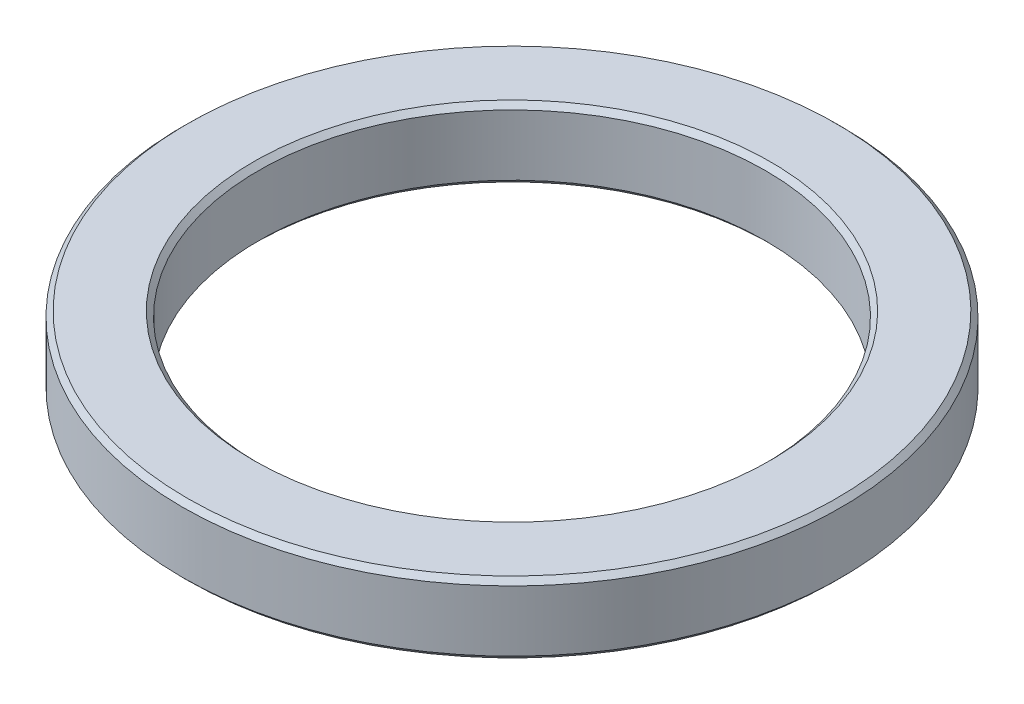
ISO-10303-21;
HEADER;
FILE_DESCRIPTION(('STEP AP214'),'2;1');
FILE_NAME('part.step','',(''),(''),'','','');
FILE_SCHEMA(('AUTOMOTIVE_DESIGN { 1 0 10303 214 1 1 1 1 }'));
ENDSEC;
DATA;
#1=APPLICATION_CONTEXT('core data for automotive mechanical design processes');
#2=APPLICATION_PROTOCOL_DEFINITION('international standard','automotive_design',2000,#1);
#3=PRODUCT_CONTEXT('',#1,'mechanical');
#4=PRODUCT('Part','Part','',(#3));
#5=PRODUCT_RELATED_PRODUCT_CATEGORY('part','',(#4));
#6=PRODUCT_DEFINITION_FORMATION('','',#4);
#7=PRODUCT_DEFINITION_CONTEXT('part definition',#1,'design');
#8=PRODUCT_DEFINITION('design','',#6,#7);
#9=PRODUCT_DEFINITION_SHAPE('','',#8);
#10=(LENGTH_UNIT() NAMED_UNIT(*) SI_UNIT(.MILLI.,.METRE.));
#11=(NAMED_UNIT(*) PLANE_ANGLE_UNIT() SI_UNIT($,.RADIAN.));
#12=(NAMED_UNIT(*) SI_UNIT($,.STERADIAN.) SOLID_ANGLE_UNIT());
#13=UNCERTAINTY_MEASURE_WITH_UNIT(LENGTH_MEASURE(1.E-05),#10,'distance_accuracy_value','');
#14=(GEOMETRIC_REPRESENTATION_CONTEXT(3) GLOBAL_UNCERTAINTY_ASSIGNED_CONTEXT((#13)) GLOBAL_UNIT_ASSIGNED_CONTEXT((#10,
#11,#12)) REPRESENTATION_CONTEXT('',''));
#15=CARTESIAN_POINT('',(0.,0.,0.));
#16=DIRECTION('',(0.,0.,1.));
#17=DIRECTION('',(1.,0.,0.));
#18=AXIS2_PLACEMENT_3D('',#15,#16,#17);
#19=CARTESIAN_POINT('',(0.,7.,0.));
#20=DIRECTION('',(0.,1.,0.));
#21=DIRECTION('',(0.,0.,1.));
#22=AXIS2_PLACEMENT_3D('',#19,#20,#21);
#23=PLANE('',#22);
#24=CARTESIAN_POINT('',(0.,7.,0.));
#25=DIRECTION('',(0.,1.,0.));
#26=DIRECTION('',(0.,0.,1.));
#27=AXIS2_PLACEMENT_3D('',#24,#25,#26);
#28=CIRCLE('',#27,25.5);
#29=CARTESIAN_POINT('',(0.,7.,25.5));
#30=VERTEX_POINT('',#29);
#31=EDGE_CURVE('E10',#30,#30,#28,.F.);
#32=ORIENTED_EDGE('',*,*,#31,.T.);
#33=EDGE_LOOP('',(#32));
#34=FACE_BOUND('',#33,.T.);
#35=CARTESIAN_POINT('',(0.,7.,0.));
#36=DIRECTION('',(0.,1.,0.));
#37=DIRECTION('',(0.,0.,1.));
#38=AXIS2_PLACEMENT_3D('',#35,#36,#37);
#39=CIRCLE('',#38,32.);
#40=CARTESIAN_POINT('',(0.,7.,32.));
#41=VERTEX_POINT('',#40);
#42=EDGE_CURVE('E51',#41,#41,#39,.T.);
#43=ORIENTED_EDGE('',*,*,#42,.T.);
#44=EDGE_LOOP('',(#43));
#45=FACE_BOUND('',#44,.T.);
#46=ADVANCED_FACE('F43',(#34,#45),#23,.T.);
#47=CARTESIAN_POINT('',(0.,0.,0.));
#48=DIRECTION('',(0.,1.,0.));
#49=DIRECTION('',(0.,0.,1.));
#50=AXIS2_PLACEMENT_3D('',#47,#48,#49);
#51=PLANE('',#50);
#52=CARTESIAN_POINT('',(0.,0.,0.));
#53=DIRECTION('',(0.,1.,0.));
#54=DIRECTION('',(0.,0.,1.));
#55=AXIS2_PLACEMENT_3D('',#52,#53,#54);
#56=CIRCLE('',#55,25.5);
#57=CARTESIAN_POINT('',(0.,0.,25.5));
#58=VERTEX_POINT('',#57);
#59=EDGE_CURVE('E70',#58,#58,#56,.T.);
#60=ORIENTED_EDGE('',*,*,#59,.T.);
#61=EDGE_LOOP('',(#60));
#62=FACE_BOUND('',#61,.T.);
#63=CARTESIAN_POINT('',(0.,0.,0.));
#64=DIRECTION('',(0.,1.,0.));
#65=DIRECTION('',(0.,0.,1.));
#66=AXIS2_PLACEMENT_3D('',#63,#64,#65);
#67=CIRCLE('',#66,32.);
#68=CARTESIAN_POINT('',(0.,0.,32.));
#69=VERTEX_POINT('',#68);
#70=EDGE_CURVE('E73',#69,#69,#67,.F.);
#71=ORIENTED_EDGE('',*,*,#70,.T.);
#72=EDGE_LOOP('',(#71));
#73=FACE_BOUND('',#72,.T.);
#74=ADVANCED_FACE('F77',(#62,#73),#51,.F.);
#75=CARTESIAN_POINT('',(0.,7.,0.));
#76=DIRECTION('',(0.,-1.,0.));
#77=DIRECTION('',(0.,0.,-1.));
#78=AXIS2_PLACEMENT_3D('',#75,#76,#77);
#79=CYLINDRICAL_SURFACE('',#78,32.5);
#80=CARTESIAN_POINT('',(0.,0.499999999999994,0.));
#81=DIRECTION('',(0.,1.,0.));
#82=DIRECTION('',(0.,0.,1.));
#83=AXIS2_PLACEMENT_3D('',#80,#81,#82);
#84=CIRCLE('',#83,32.5);
#85=CARTESIAN_POINT('',(0.,0.499999999999994,32.5));
#86=VERTEX_POINT('',#85);
#87=EDGE_CURVE('E55',#86,#86,#84,.T.);
#88=ORIENTED_EDGE('',*,*,#87,.T.);
#89=EDGE_LOOP('',(#88));
#90=FACE_BOUND('',#89,.T.);
#91=CARTESIAN_POINT('',(0.,6.5,0.));
#92=DIRECTION('',(0.,1.,0.));
#93=DIRECTION('',(0.,0.,1.));
#94=AXIS2_PLACEMENT_3D('',#91,#92,#93);
#95=CIRCLE('',#94,32.5);
#96=CARTESIAN_POINT('',(0.,6.5,32.5));
#97=VERTEX_POINT('',#96);
#98=EDGE_CURVE('E59',#97,#97,#95,.F.);
#99=ORIENTED_EDGE('',*,*,#98,.T.);
#100=EDGE_LOOP('',(#99));
#101=FACE_BOUND('',#100,.T.);
#102=ADVANCED_FACE('F87',(#90,#101),#79,.T.);
#103=CARTESIAN_POINT('',(0.,7.,0.));
#104=DIRECTION('',(0.,-1.,0.));
#105=DIRECTION('',(0.,0.,-1.));
#106=AXIS2_PLACEMENT_3D('',#103,#104,#105);
#107=CYLINDRICAL_SURFACE('',#106,25.);
#108=CARTESIAN_POINT('',(0.,0.500000000000021,0.));
#109=DIRECTION('',(0.,1.,0.));
#110=DIRECTION('',(0.,0.,1.));
#111=AXIS2_PLACEMENT_3D('',#108,#109,#110);
#112=CIRCLE('',#111,25.);
#113=CARTESIAN_POINT('',(0.,0.500000000000021,25.));
#114=VERTEX_POINT('',#113);
#115=EDGE_CURVE('E64',#114,#114,#112,.F.);
#116=ORIENTED_EDGE('',*,*,#115,.T.);
#117=EDGE_LOOP('',(#116));
#118=FACE_BOUND('',#117,.T.);
#119=CARTESIAN_POINT('',(0.,6.49999999999998,0.));
#120=DIRECTION('',(0.,1.,0.));
#121=DIRECTION('',(0.,0.,1.));
#122=AXIS2_PLACEMENT_3D('',#119,#120,#121);
#123=CIRCLE('',#122,25.);
#124=CARTESIAN_POINT('',(0.,6.49999999999998,25.));
#125=VERTEX_POINT('',#124);
#126=EDGE_CURVE('E67',#125,#125,#123,.T.);
#127=ORIENTED_EDGE('',*,*,#126,.T.);
#128=EDGE_LOOP('',(#127));
#129=FACE_BOUND('',#128,.T.);
#130=ADVANCED_FACE('F90',(#118,#129),#107,.F.);
#131=CARTESIAN_POINT('',(0.,0.,0.));
#132=DIRECTION('',(0.,-1.,0.));
#133=DIRECTION('',(0.,0.,-1.));
#134=AXIS2_PLACEMENT_3D('',#131,#132,#133);
#135=CONICAL_SURFACE('',#134,25.5,0.785398163397445);
#136=ORIENTED_EDGE('',*,*,#115,.F.);
#137=EDGE_LOOP('',(#136));
#138=FACE_BOUND('',#137,.T.);
#139=ORIENTED_EDGE('',*,*,#59,.F.);
#140=EDGE_LOOP('',(#139));
#141=FACE_BOUND('',#140,.T.);
#142=ADVANCED_FACE('F83',(#138,#141),#135,.F.);
#143=CARTESIAN_POINT('',(0.,0.499999999999994,0.));
#144=DIRECTION('',(0.,1.,0.));
#145=DIRECTION('',(0.,0.,1.));
#146=AXIS2_PLACEMENT_3D('',#143,#144,#145);
#147=CONICAL_SURFACE('',#146,32.5,0.785398163397455);
#148=ORIENTED_EDGE('',*,*,#70,.F.);
#149=EDGE_LOOP('',(#148));
#150=FACE_BOUND('',#149,.T.);
#151=ORIENTED_EDGE('',*,*,#87,.F.);
#152=EDGE_LOOP('',(#151));
#153=FACE_BOUND('',#152,.T.);
#154=ADVANCED_FACE('F79',(#150,#153),#147,.T.);
#155=CARTESIAN_POINT('',(0.,6.49999999999998,0.));
#156=DIRECTION('',(0.,1.,0.));
#157=DIRECTION('',(0.,0.,1.));
#158=AXIS2_PLACEMENT_3D('',#155,#156,#157);
#159=CONICAL_SURFACE('',#158,25.,0.785398163397445);
#160=ORIENTED_EDGE('',*,*,#31,.F.);
#161=EDGE_LOOP('',(#160));
#162=FACE_BOUND('',#161,.T.);
#163=ORIENTED_EDGE('',*,*,#126,.F.);
#164=EDGE_LOOP('',(#163));
#165=FACE_BOUND('',#164,.T.);
#166=ADVANCED_FACE('F82',(#162,#165),#159,.F.);
#167=CARTESIAN_POINT('',(0.,7.,0.));
#168=DIRECTION('',(0.,-1.,0.));
#169=DIRECTION('',(0.,0.,-1.));
#170=AXIS2_PLACEMENT_3D('',#167,#168,#169);
#171=CONICAL_SURFACE('',#170,32.,0.785398163397462);
#172=ORIENTED_EDGE('',*,*,#98,.F.);
#173=EDGE_LOOP('',(#172));
#174=FACE_BOUND('',#173,.T.);
#175=ORIENTED_EDGE('',*,*,#42,.F.);
#176=EDGE_LOOP('',(#175));
#177=FACE_BOUND('',#176,.T.);
#178=ADVANCED_FACE('F46',(#174,#177),#171,.T.);
#179=CLOSED_SHELL('',(#46,#74,#102,#130,#142,#154,#166,#178));
#180=MANIFOLD_SOLID_BREP('B2',#179);
#181=ADVANCED_BREP_SHAPE_REPRESENTATION('',(#18,#180),#14);
#182=SHAPE_DEFINITION_REPRESENTATION(#9,#181);
ENDSEC;
END-ISO-10303-21;
